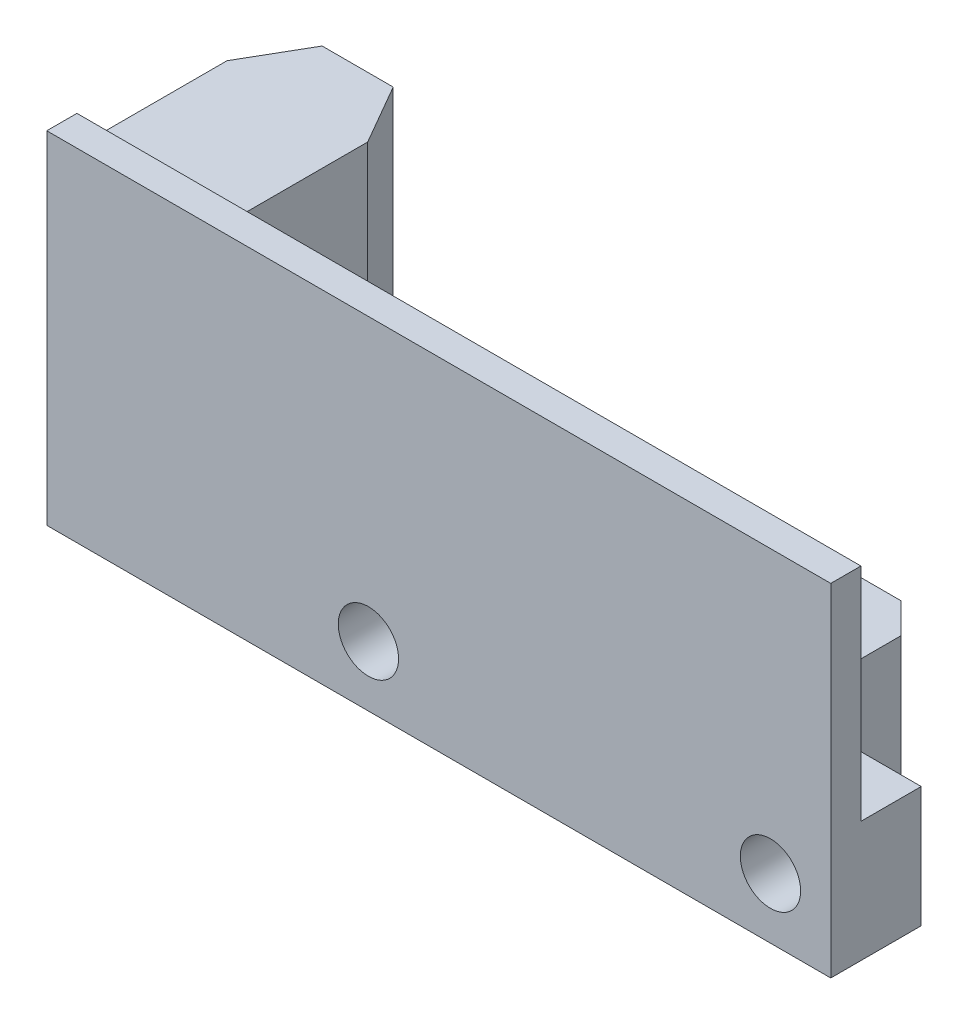
ISO-10303-21;
HEADER;
FILE_DESCRIPTION(('STEP AP214'),'2;1');
FILE_NAME('part.step','',(''),(''),'','','');
FILE_SCHEMA(('AUTOMOTIVE_DESIGN { 1 0 10303 214 1 1 1 1 }'));
ENDSEC;
DATA;
#1=APPLICATION_CONTEXT('core data for automotive mechanical design processes');
#2=APPLICATION_PROTOCOL_DEFINITION('international standard','automotive_design',2000,#1);
#3=PRODUCT_CONTEXT('',#1,'mechanical');
#4=PRODUCT('Part','Part','',(#3));
#5=PRODUCT_RELATED_PRODUCT_CATEGORY('part','',(#4));
#6=PRODUCT_DEFINITION_FORMATION('','',#4);
#7=PRODUCT_DEFINITION_CONTEXT('part definition',#1,'design');
#8=PRODUCT_DEFINITION('design','',#6,#7);
#9=PRODUCT_DEFINITION_SHAPE('','',#8);
#10=(LENGTH_UNIT() NAMED_UNIT(*) SI_UNIT(.MILLI.,.METRE.));
#11=(NAMED_UNIT(*) PLANE_ANGLE_UNIT() SI_UNIT($,.RADIAN.));
#12=(NAMED_UNIT(*) SI_UNIT($,.STERADIAN.) SOLID_ANGLE_UNIT());
#13=UNCERTAINTY_MEASURE_WITH_UNIT(LENGTH_MEASURE(1.E-05),#10,'distance_accuracy_value','');
#14=(GEOMETRIC_REPRESENTATION_CONTEXT(3) GLOBAL_UNCERTAINTY_ASSIGNED_CONTEXT((#13)) GLOBAL_UNIT_ASSIGNED_CONTEXT((#10,
#11,#12)) REPRESENTATION_CONTEXT('',''));
#15=CARTESIAN_POINT('',(0.,0.,0.));
#16=DIRECTION('',(0.,0.,1.));
#17=DIRECTION('',(1.,0.,0.));
#18=AXIS2_PLACEMENT_3D('',#15,#16,#17);
#19=CARTESIAN_POINT('',(0.,0.,0.));
#20=DIRECTION('',(0.,0.,1.));
#21=DIRECTION('',(1.,0.,0.));
#22=AXIS2_PLACEMENT_3D('',#19,#20,#21);
#23=PLANE('',#22);
#24=DIRECTION('',(1.,0.,0.));
#25=VECTOR('',#24,1.);
#26=CARTESIAN_POINT('',(-5.50000000000001,-2.5,0.));
#27=LINE('',#26,#25);
#28=CARTESIAN_POINT('',(-5.50000000000001,-2.5,0.));
#29=VERTEX_POINT('',#28);
#30=CARTESIAN_POINT('',(19.5,-2.5,0.));
#31=VERTEX_POINT('',#30);
#32=EDGE_CURVE('E280',#29,#31,#27,.T.);
#33=ORIENTED_EDGE('',*,*,#32,.F.);
#34=DIRECTION('',(0.,-1.,0.));
#35=VECTOR('',#34,1.);
#36=CARTESIAN_POINT('',(-5.50000000000001,-2.5,0.));
#37=LINE('',#36,#35);
#38=CARTESIAN_POINT('',(-5.50000000000001,-8.49999999999999,0.));
#39=VERTEX_POINT('',#38);
#40=EDGE_CURVE('E247',#29,#39,#37,.T.);
#41=ORIENTED_EDGE('',*,*,#40,.T.);
#42=DIRECTION('',(1.,0.,0.));
#43=VECTOR('',#42,1.);
#44=CARTESIAN_POINT('',(-19.5,-8.49999999999999,0.));
#45=LINE('',#44,#43);
#46=CARTESIAN_POINT('',(-19.5,-8.49999999999999,0.));
#47=VERTEX_POINT('',#46);
#48=EDGE_CURVE('E276',#47,#39,#45,.T.);
#49=ORIENTED_EDGE('',*,*,#48,.F.);
#50=DIRECTION('',(0.,-1.,0.));
#51=VECTOR('',#50,1.);
#52=CARTESIAN_POINT('',(-19.5,8.50000000000001,0.));
#53=LINE('',#52,#51);
#54=CARTESIAN_POINT('',(-19.5,8.50000000000001,0.));
#55=VERTEX_POINT('',#54);
#56=EDGE_CURVE('E441',#55,#47,#53,.T.);
#57=ORIENTED_EDGE('',*,*,#56,.F.);
#58=DIRECTION('',(-1.,0.,0.));
#59=VECTOR('',#58,1.);
#60=CARTESIAN_POINT('',(-19.5,8.50000000000001,0.));
#61=LINE('',#60,#59);
#62=CARTESIAN_POINT('',(19.5,8.50000000000001,0.));
#63=VERTEX_POINT('',#62);
#64=EDGE_CURVE('E437',#63,#55,#61,.T.);
#65=ORIENTED_EDGE('',*,*,#64,.F.);
#66=DIRECTION('',(0.,1.,0.));
#67=VECTOR('',#66,1.);
#68=CARTESIAN_POINT('',(19.5,8.50000000000001,0.));
#69=LINE('',#68,#67);
#70=EDGE_CURVE('E435',#31,#63,#69,.T.);
#71=ORIENTED_EDGE('',*,*,#70,.F.);
#72=EDGE_LOOP('',(#33,#41,#49,#57,#65,#71));
#73=FACE_BOUND('',#72,.T.);
#74=DIRECTION('',(0.,-1.,0.));
#75=VECTOR('',#74,1.);
#76=CARTESIAN_POINT('',(-12.0341939058667,7.5,0.));
#77=LINE('',#76,#75);
#78=CARTESIAN_POINT('',(-12.0341939058667,7.5,0.));
#79=VERTEX_POINT('',#78);
#80=CARTESIAN_POINT('',(-12.0341939058667,-7.5,0.));
#81=VERTEX_POINT('',#80);
#82=EDGE_CURVE('E185',#79,#81,#77,.T.);
#83=ORIENTED_EDGE('',*,*,#82,.F.);
#84=DIRECTION('',(1.,0.,0.));
#85=VECTOR('',#84,1.);
#86=CARTESIAN_POINT('',(-19.0341939058667,7.5,0.));
#87=LINE('',#86,#85);
#88=CARTESIAN_POINT('',(-19.0341939058667,7.5,0.));
#89=VERTEX_POINT('',#88);
#90=EDGE_CURVE('E197',#89,#79,#87,.T.);
#91=ORIENTED_EDGE('',*,*,#90,.F.);
#92=DIRECTION('',(0.,1.,0.));
#93=VECTOR('',#92,1.);
#94=CARTESIAN_POINT('',(-19.0341939058667,7.5,0.));
#95=LINE('',#94,#93);
#96=CARTESIAN_POINT('',(-19.0341939058667,-7.5,0.));
#97=VERTEX_POINT('',#96);
#98=EDGE_CURVE('E205',#97,#89,#95,.T.);
#99=ORIENTED_EDGE('',*,*,#98,.F.);
#100=DIRECTION('',(-1.,0.,0.));
#101=VECTOR('',#100,1.);
#102=CARTESIAN_POINT('',(-19.0341939058667,-7.5,0.));
#103=LINE('',#102,#101);
#104=EDGE_CURVE('E200',#81,#97,#103,.T.);
#105=ORIENTED_EDGE('',*,*,#104,.F.);
#106=EDGE_LOOP('',(#83,#91,#99,#105));
#107=FACE_BOUND('',#106,.T.);
#108=ADVANCED_FACE('F33',(#73,#107),#23,.F.);
#109=CARTESIAN_POINT('',(19.5,8.50000000000001,1.5));
#110=DIRECTION('',(-1.,0.,0.));
#111=DIRECTION('',(0.,-1.,0.));
#112=AXIS2_PLACEMENT_3D('',#109,#110,#111);
#113=PLANE('',#112);
#114=DIRECTION('',(0.,0.,-1.));
#115=VECTOR('',#114,1.);
#116=CARTESIAN_POINT('',(19.5,-8.49999999999999,1.5));
#117=LINE('',#116,#115);
#118=CARTESIAN_POINT('',(19.5,-8.49999999999999,1.5));
#119=VERTEX_POINT('',#118);
#120=CARTESIAN_POINT('',(19.5,-8.49999999999999,-3.));
#121=VERTEX_POINT('',#120);
#122=EDGE_CURVE('E455',#119,#121,#117,.T.);
#123=ORIENTED_EDGE('',*,*,#122,.T.);
#124=DIRECTION('',(0.,-1.,0.));
#125=VECTOR('',#124,1.);
#126=CARTESIAN_POINT('',(19.5,-2.5,-3.));
#127=LINE('',#126,#125);
#128=CARTESIAN_POINT('',(19.5,-2.5,-3.));
#129=VERTEX_POINT('',#128);
#130=EDGE_CURVE('E440',#129,#121,#127,.T.);
#131=ORIENTED_EDGE('',*,*,#130,.F.);
#132=DIRECTION('',(0.,0.,-1.));
#133=VECTOR('',#132,1.);
#134=CARTESIAN_POINT('',(19.5,-2.5,0.));
#135=LINE('',#134,#133);
#136=EDGE_CURVE('E228',#31,#129,#135,.T.);
#137=ORIENTED_EDGE('',*,*,#136,.F.);
#138=ORIENTED_EDGE('',*,*,#70,.T.);
#139=DIRECTION('',(0.,0.,-1.));
#140=VECTOR('',#139,1.);
#141=CARTESIAN_POINT('',(19.5,8.50000000000001,1.5));
#142=LINE('',#141,#140);
#143=CARTESIAN_POINT('',(19.5,8.50000000000001,1.5));
#144=VERTEX_POINT('',#143);
#145=EDGE_CURVE('E298',#144,#63,#142,.T.);
#146=ORIENTED_EDGE('',*,*,#145,.F.);
#147=DIRECTION('',(0.,1.,0.));
#148=VECTOR('',#147,1.);
#149=CARTESIAN_POINT('',(19.5,8.50000000000001,1.5));
#150=LINE('',#149,#148);
#151=EDGE_CURVE('E466',#119,#144,#150,.T.);
#152=ORIENTED_EDGE('',*,*,#151,.F.);
#153=EDGE_LOOP('',(#123,#131,#137,#138,#146,#152));
#154=FACE_BOUND('',#153,.T.);
#155=ADVANCED_FACE('F332',(#154),#113,.F.);
#156=CARTESIAN_POINT('',(-19.5,8.50000000000001,1.5));
#157=DIRECTION('',(0.,-1.,0.));
#158=DIRECTION('',(0.,0.,-1.));
#159=AXIS2_PLACEMENT_3D('',#156,#157,#158);
#160=PLANE('',#159);
#161=ORIENTED_EDGE('',*,*,#64,.T.);
#162=DIRECTION('',(0.,0.,-1.));
#163=VECTOR('',#162,1.);
#164=CARTESIAN_POINT('',(-19.5,8.50000000000001,1.5));
#165=LINE('',#164,#163);
#166=CARTESIAN_POINT('',(-19.5,8.50000000000001,1.5));
#167=VERTEX_POINT('',#166);
#168=EDGE_CURVE('E459',#167,#55,#165,.T.);
#169=ORIENTED_EDGE('',*,*,#168,.F.);
#170=DIRECTION('',(-1.,0.,0.));
#171=VECTOR('',#170,1.);
#172=CARTESIAN_POINT('',(-19.5,8.50000000000001,1.5));
#173=LINE('',#172,#171);
#174=EDGE_CURVE('E463',#144,#167,#173,.T.);
#175=ORIENTED_EDGE('',*,*,#174,.F.);
#176=ORIENTED_EDGE('',*,*,#145,.T.);
#177=EDGE_LOOP('',(#161,#169,#175,#176));
#178=FACE_BOUND('',#177,.T.);
#179=ADVANCED_FACE('F338',(#178),#160,.F.);
#180=CARTESIAN_POINT('',(-19.5,8.50000000000001,1.5));
#181=DIRECTION('',(1.,0.,0.));
#182=DIRECTION('',(0.,1.,0.));
#183=AXIS2_PLACEMENT_3D('',#180,#181,#182);
#184=PLANE('',#183);
#185=ORIENTED_EDGE('',*,*,#56,.T.);
#186=DIRECTION('',(0.,0.,-1.));
#187=VECTOR('',#186,1.);
#188=CARTESIAN_POINT('',(-19.5,-8.49999999999999,1.5));
#189=LINE('',#188,#187);
#190=CARTESIAN_POINT('',(-19.5,-8.49999999999999,1.5));
#191=VERTEX_POINT('',#190);
#192=EDGE_CURVE('E457',#191,#47,#189,.T.);
#193=ORIENTED_EDGE('',*,*,#192,.F.);
#194=DIRECTION('',(0.,-1.,0.));
#195=VECTOR('',#194,1.);
#196=CARTESIAN_POINT('',(-19.5,8.50000000000001,1.5));
#197=LINE('',#196,#195);
#198=EDGE_CURVE('E470',#167,#191,#197,.T.);
#199=ORIENTED_EDGE('',*,*,#198,.F.);
#200=ORIENTED_EDGE('',*,*,#168,.T.);
#201=EDGE_LOOP('',(#185,#193,#199,#200));
#202=FACE_BOUND('',#201,.T.);
#203=ADVANCED_FACE('F349',(#202),#184,.F.);
#204=CARTESIAN_POINT('',(-19.5,-8.49999999999999,1.5));
#205=DIRECTION('',(0.,1.,0.));
#206=DIRECTION('',(0.,0.,1.));
#207=AXIS2_PLACEMENT_3D('',#204,#205,#206);
#208=PLANE('',#207);
#209=DIRECTION('',(-1.,0.,0.));
#210=VECTOR('',#209,1.);
#211=CARTESIAN_POINT('',(12.5,-8.49999999999999,-10.5));
#212=LINE('',#211,#210);
#213=CARTESIAN_POINT('',(11.,-8.49999999999999,-10.5));
#214=VERTEX_POINT('',#213);
#215=CARTESIAN_POINT('',(8.49999999999999,-8.49999999999999,-10.5));
#216=VERTEX_POINT('',#215);
#217=EDGE_CURVE('E253',#214,#216,#212,.T.);
#218=ORIENTED_EDGE('',*,*,#217,.F.);
#219=DIRECTION('',(-0.707106781186546,0.,-0.707106781186549));
#220=VECTOR('',#219,1.);
#221=CARTESIAN_POINT('',(11.,-8.49999999999999,-10.5));
#222=LINE('',#221,#220);
#223=CARTESIAN_POINT('',(12.5,-8.49999999999999,-8.99999999999999));
#224=VERTEX_POINT('',#223);
#225=EDGE_CURVE('E297',#214,#224,#222,.F.);
#226=ORIENTED_EDGE('',*,*,#225,.T.);
#227=DIRECTION('',(0.,0.,-1.));
#228=VECTOR('',#227,1.);
#229=CARTESIAN_POINT('',(12.5,-8.49999999999999,-3.));
#230=LINE('',#229,#228);
#231=CARTESIAN_POINT('',(12.5,-8.49999999999999,-3.));
#232=VERTEX_POINT('',#231);
#233=EDGE_CURVE('E250',#232,#224,#230,.T.);
#234=ORIENTED_EDGE('',*,*,#233,.F.);
#235=DIRECTION('',(-1.,0.,0.));
#236=VECTOR('',#235,1.);
#237=CARTESIAN_POINT('',(19.5,-8.49999999999999,-3.));
#238=LINE('',#237,#236);
#239=EDGE_CURVE('E248',#121,#232,#238,.T.);
#240=ORIENTED_EDGE('',*,*,#239,.F.);
#241=ORIENTED_EDGE('',*,*,#122,.F.);
#242=DIRECTION('',(1.,0.,0.));
#243=VECTOR('',#242,1.);
#244=CARTESIAN_POINT('',(-19.5,-8.49999999999999,1.5));
#245=LINE('',#244,#243);
#246=EDGE_CURVE('E450',#191,#119,#245,.T.);
#247=ORIENTED_EDGE('',*,*,#246,.F.);
#248=ORIENTED_EDGE('',*,*,#192,.T.);
#249=ORIENTED_EDGE('',*,*,#48,.T.);
#250=DIRECTION('',(0.,0.,1.));
#251=VECTOR('',#250,1.);
#252=CARTESIAN_POINT('',(-5.50000000000001,-8.49999999999999,-3.));
#253=LINE('',#252,#251);
#254=CARTESIAN_POINT('',(-5.50000000000001,-8.49999999999999,-3.));
#255=VERTEX_POINT('',#254);
#256=EDGE_CURVE('E267',#255,#39,#253,.T.);
#257=ORIENTED_EDGE('',*,*,#256,.F.);
#258=DIRECTION('',(-1.,0.,0.));
#259=VECTOR('',#258,1.);
#260=CARTESIAN_POINT('',(1.5,-8.49999999999999,-3.));
#261=LINE('',#260,#259);
#262=CARTESIAN_POINT('',(1.5,-8.49999999999999,-3.));
#263=VERTEX_POINT('',#262);
#264=EDGE_CURVE('E265',#263,#255,#261,.T.);
#265=ORIENTED_EDGE('',*,*,#264,.F.);
#266=DIRECTION('',(0.,0.,1.));
#267=VECTOR('',#266,1.);
#268=CARTESIAN_POINT('',(1.49999999999999,-8.49999999999999,-10.5));
#269=LINE('',#268,#267);
#270=CARTESIAN_POINT('',(1.49999999999999,-8.49999999999999,-10.5));
#271=VERTEX_POINT('',#270);
#272=EDGE_CURVE('E263',#271,#263,#269,.T.);
#273=ORIENTED_EDGE('',*,*,#272,.F.);
#274=DIRECTION('',(-1.,0.,0.));
#275=VECTOR('',#274,1.);
#276=CARTESIAN_POINT('',(5.49999999999999,-8.49999999999999,-10.5));
#277=LINE('',#276,#275);
#278=CARTESIAN_POINT('',(5.49999999999999,-8.49999999999999,-10.5));
#279=VERTEX_POINT('',#278);
#280=EDGE_CURVE('E261',#279,#271,#277,.T.);
#281=ORIENTED_EDGE('',*,*,#280,.F.);
#282=DIRECTION('',(0.,0.,-1.));
#283=VECTOR('',#282,1.);
#284=CARTESIAN_POINT('',(5.49999999999999,-8.49999999999999,-3.));
#285=LINE('',#284,#283);
#286=CARTESIAN_POINT('',(5.49999999999999,-8.49999999999999,-3.));
#287=VERTEX_POINT('',#286);
#288=EDGE_CURVE('E259',#287,#279,#285,.T.);
#289=ORIENTED_EDGE('',*,*,#288,.F.);
#290=DIRECTION('',(-1.,0.,0.));
#291=VECTOR('',#290,1.);
#292=CARTESIAN_POINT('',(8.49999999999999,-8.49999999999999,-3.));
#293=LINE('',#292,#291);
#294=CARTESIAN_POINT('',(8.49999999999999,-8.49999999999999,-3.));
#295=VERTEX_POINT('',#294);
#296=EDGE_CURVE('E257',#295,#287,#293,.T.);
#297=ORIENTED_EDGE('',*,*,#296,.F.);
#298=DIRECTION('',(0.,0.,1.));
#299=VECTOR('',#298,1.);
#300=CARTESIAN_POINT('',(8.49999999999999,-8.49999999999999,-10.5));
#301=LINE('',#300,#299);
#302=EDGE_CURVE('E255',#216,#295,#301,.T.);
#303=ORIENTED_EDGE('',*,*,#302,.F.);
#304=EDGE_LOOP('',(#218,#226,#234,#240,#241,#247,#248,#249,#257,#265,#273,#281,#289,#297,#303));
#305=FACE_BOUND('',#304,.T.);
#306=ADVANCED_FACE('F346',(#305),#208,.F.);
#307=CARTESIAN_POINT('',(0.,0.,1.5));
#308=DIRECTION('',(0.,0.,1.));
#309=DIRECTION('',(1.,0.,0.));
#310=AXIS2_PLACEMENT_3D('',#307,#308,#309);
#311=PLANE('',#310);
#312=CARTESIAN_POINT('',(-3.50000000000001,-5.49999999999999,1.5));
#313=DIRECTION('',(0.,0.,1.));
#314=DIRECTION('',(1.,0.,0.));
#315=AXIS2_PLACEMENT_3D('',#312,#313,#314);
#316=CIRCLE('',#315,1.5);
#317=CARTESIAN_POINT('',(-2.00000000000001,-5.49999999999999,1.5));
#318=VERTEX_POINT('',#317);
#319=EDGE_CURVE('E217',#318,#318,#316,.T.);
#320=ORIENTED_EDGE('',*,*,#319,.F.);
#321=EDGE_LOOP('',(#320));
#322=FACE_BOUND('',#321,.T.);
#323=CARTESIAN_POINT('',(16.5,-5.49999999999999,1.5));
#324=DIRECTION('',(0.,0.,1.));
#325=DIRECTION('',(1.,0.,0.));
#326=AXIS2_PLACEMENT_3D('',#323,#324,#325);
#327=CIRCLE('',#326,1.5);
#328=CARTESIAN_POINT('',(18.,-5.49999999999999,1.5));
#329=VERTEX_POINT('',#328);
#330=EDGE_CURVE('E221',#329,#329,#327,.T.);
#331=ORIENTED_EDGE('',*,*,#330,.F.);
#332=EDGE_LOOP('',(#331));
#333=FACE_BOUND('',#332,.T.);
#334=ORIENTED_EDGE('',*,*,#151,.T.);
#335=ORIENTED_EDGE('',*,*,#174,.T.);
#336=ORIENTED_EDGE('',*,*,#198,.T.);
#337=ORIENTED_EDGE('',*,*,#246,.T.);
#338=EDGE_LOOP('',(#334,#335,#336,#337));
#339=FACE_BOUND('',#338,.T.);
#340=ADVANCED_FACE('F344',(#322,#333,#339),#311,.T.);
#341=CARTESIAN_POINT('',(19.5,-2.5,-3.));
#342=DIRECTION('',(0.,0.,1.));
#343=DIRECTION('',(1.,0.,0.));
#344=AXIS2_PLACEMENT_3D('',#341,#342,#343);
#345=PLANE('',#344);
#346=CARTESIAN_POINT('',(16.5,-5.49999999999999,-3.));
#347=DIRECTION('',(0.,0.,1.));
#348=DIRECTION('',(1.,0.,0.));
#349=AXIS2_PLACEMENT_3D('',#346,#347,#348);
#350=CIRCLE('',#349,1.5);
#351=CARTESIAN_POINT('',(18.,-5.49999999999999,-3.));
#352=VERTEX_POINT('',#351);
#353=EDGE_CURVE('E224',#352,#352,#350,.T.);
#354=ORIENTED_EDGE('',*,*,#353,.T.);
#355=EDGE_LOOP('',(#354));
#356=FACE_BOUND('',#355,.T.);
#357=ORIENTED_EDGE('',*,*,#239,.T.);
#358=DIRECTION('',(0.,-1.,0.));
#359=VECTOR('',#358,1.);
#360=CARTESIAN_POINT('',(12.5,-2.5,-3.));
#361=LINE('',#360,#359);
#362=CARTESIAN_POINT('',(12.5,-2.5,-3.));
#363=VERTEX_POINT('',#362);
#364=EDGE_CURVE('E385',#363,#232,#361,.T.);
#365=ORIENTED_EDGE('',*,*,#364,.F.);
#366=DIRECTION('',(-1.,0.,0.));
#367=VECTOR('',#366,1.);
#368=CARTESIAN_POINT('',(19.5,-2.5,-3.));
#369=LINE('',#368,#367);
#370=EDGE_CURVE('E225',#129,#363,#369,.T.);
#371=ORIENTED_EDGE('',*,*,#370,.F.);
#372=ORIENTED_EDGE('',*,*,#130,.T.);
#373=EDGE_LOOP('',(#357,#365,#371,#372));
#374=FACE_BOUND('',#373,.T.);
#375=ADVANCED_FACE('F481',(#356,#374),#345,.F.);
#376=CARTESIAN_POINT('',(12.5,-2.5,-3.));
#377=DIRECTION('',(-1.,0.,0.));
#378=DIRECTION('',(0.,0.,1.));
#379=AXIS2_PLACEMENT_3D('',#376,#377,#378);
#380=PLANE('',#379);
#381=ORIENTED_EDGE('',*,*,#233,.T.);
#382=DIRECTION('',(0.,1.,0.));
#383=VECTOR('',#382,1.);
#384=CARTESIAN_POINT('',(12.5,-2.5,-8.99999999999999));
#385=LINE('',#384,#383);
#386=CARTESIAN_POINT('',(12.5,-2.5,-8.99999999999999));
#387=VERTEX_POINT('',#386);
#388=EDGE_CURVE('E300',#224,#387,#385,.T.);
#389=ORIENTED_EDGE('',*,*,#388,.T.);
#390=DIRECTION('',(0.,0.,-1.));
#391=VECTOR('',#390,1.);
#392=CARTESIAN_POINT('',(12.5,-2.5,-3.));
#393=LINE('',#392,#391);
#394=EDGE_CURVE('E227',#363,#387,#393,.T.);
#395=ORIENTED_EDGE('',*,*,#394,.F.);
#396=ORIENTED_EDGE('',*,*,#364,.T.);
#397=EDGE_LOOP('',(#381,#389,#395,#396));
#398=FACE_BOUND('',#397,.T.);
#399=ADVANCED_FACE('F484',(#398),#380,.F.);
#400=CARTESIAN_POINT('',(12.5,-2.5,-10.5));
#401=DIRECTION('',(0.,0.,1.));
#402=DIRECTION('',(1.,0.,0.));
#403=AXIS2_PLACEMENT_3D('',#400,#401,#402);
#404=PLANE('',#403);
#405=DIRECTION('',(-1.,0.,0.));
#406=VECTOR('',#405,1.);
#407=CARTESIAN_POINT('',(12.5,-2.5,-10.5));
#408=LINE('',#407,#406);
#409=CARTESIAN_POINT('',(11.,-2.5,-10.5));
#410=VERTEX_POINT('',#409);
#411=CARTESIAN_POINT('',(8.49999999999999,-2.5,-10.5));
#412=VERTEX_POINT('',#411);
#413=EDGE_CURVE('E231',#410,#412,#408,.T.);
#414=ORIENTED_EDGE('',*,*,#413,.F.);
#415=DIRECTION('',(0.,-1.,0.));
#416=VECTOR('',#415,1.);
#417=CARTESIAN_POINT('',(11.,-2.5,-10.5));
#418=LINE('',#417,#416);
#419=EDGE_CURVE('E294',#410,#214,#418,.T.);
#420=ORIENTED_EDGE('',*,*,#419,.T.);
#421=ORIENTED_EDGE('',*,*,#217,.T.);
#422=DIRECTION('',(0.,-1.,0.));
#423=VECTOR('',#422,1.);
#424=CARTESIAN_POINT('',(8.49999999999999,-2.5,-10.5));
#425=LINE('',#424,#423);
#426=EDGE_CURVE('E381',#412,#216,#425,.T.);
#427=ORIENTED_EDGE('',*,*,#426,.F.);
#428=EDGE_LOOP('',(#414,#420,#421,#427));
#429=FACE_BOUND('',#428,.T.);
#430=ADVANCED_FACE('F378',(#429),#404,.F.);
#431=CARTESIAN_POINT('',(8.49999999999999,-2.5,-10.5));
#432=DIRECTION('',(1.,0.,0.));
#433=DIRECTION('',(0.,0.,-1.));
#434=AXIS2_PLACEMENT_3D('',#431,#432,#433);
#435=PLANE('',#434);
#436=ORIENTED_EDGE('',*,*,#302,.T.);
#437=DIRECTION('',(0.,-1.,0.));
#438=VECTOR('',#437,1.);
#439=CARTESIAN_POINT('',(8.49999999999999,-2.5,-3.));
#440=LINE('',#439,#438);
#441=CARTESIAN_POINT('',(8.49999999999999,-2.5,-3.));
#442=VERTEX_POINT('',#441);
#443=EDGE_CURVE('E386',#442,#295,#440,.T.);
#444=ORIENTED_EDGE('',*,*,#443,.F.);
#445=DIRECTION('',(0.,0.,1.));
#446=VECTOR('',#445,1.);
#447=CARTESIAN_POINT('',(8.49999999999999,-2.5,-10.5));
#448=LINE('',#447,#446);
#449=EDGE_CURVE('E233',#412,#442,#448,.T.);
#450=ORIENTED_EDGE('',*,*,#449,.F.);
#451=ORIENTED_EDGE('',*,*,#426,.T.);
#452=EDGE_LOOP('',(#436,#444,#450,#451));
#453=FACE_BOUND('',#452,.T.);
#454=ADVANCED_FACE('F389',(#453),#435,.F.);
#455=CARTESIAN_POINT('',(8.49999999999999,-2.5,-3.));
#456=DIRECTION('',(0.,0.,1.));
#457=DIRECTION('',(1.,0.,0.));
#458=AXIS2_PLACEMENT_3D('',#455,#456,#457);
#459=PLANE('',#458);
#460=ORIENTED_EDGE('',*,*,#296,.T.);
#461=DIRECTION('',(0.,-1.,0.));
#462=VECTOR('',#461,1.);
#463=CARTESIAN_POINT('',(5.49999999999999,-2.5,-3.));
#464=LINE('',#463,#462);
#465=CARTESIAN_POINT('',(5.49999999999999,-2.5,-3.));
#466=VERTEX_POINT('',#465);
#467=EDGE_CURVE('E397',#466,#287,#464,.T.);
#468=ORIENTED_EDGE('',*,*,#467,.F.);
#469=DIRECTION('',(-1.,0.,0.));
#470=VECTOR('',#469,1.);
#471=CARTESIAN_POINT('',(8.49999999999999,-2.5,-3.));
#472=LINE('',#471,#470);
#473=EDGE_CURVE('E235',#442,#466,#472,.T.);
#474=ORIENTED_EDGE('',*,*,#473,.F.);
#475=ORIENTED_EDGE('',*,*,#443,.T.);
#476=EDGE_LOOP('',(#460,#468,#474,#475));
#477=FACE_BOUND('',#476,.T.);
#478=ADVANCED_FACE('F398',(#477),#459,.F.);
#479=CARTESIAN_POINT('',(5.49999999999999,-2.5,-3.));
#480=DIRECTION('',(-1.,0.,0.));
#481=DIRECTION('',(0.,0.,1.));
#482=AXIS2_PLACEMENT_3D('',#479,#480,#481);
#483=PLANE('',#482);
#484=ORIENTED_EDGE('',*,*,#288,.T.);
#485=DIRECTION('',(0.,-1.,0.));
#486=VECTOR('',#485,1.);
#487=CARTESIAN_POINT('',(5.49999999999999,-2.5,-10.5));
#488=LINE('',#487,#486);
#489=CARTESIAN_POINT('',(5.49999999999999,-2.5,-10.5));
#490=VERTEX_POINT('',#489);
#491=EDGE_CURVE('E402',#490,#279,#488,.T.);
#492=ORIENTED_EDGE('',*,*,#491,.F.);
#493=DIRECTION('',(0.,0.,-1.));
#494=VECTOR('',#493,1.);
#495=CARTESIAN_POINT('',(5.49999999999999,-2.5,-3.));
#496=LINE('',#495,#494);
#497=EDGE_CURVE('E237',#466,#490,#496,.T.);
#498=ORIENTED_EDGE('',*,*,#497,.F.);
#499=ORIENTED_EDGE('',*,*,#467,.T.);
#500=EDGE_LOOP('',(#484,#492,#498,#499));
#501=FACE_BOUND('',#500,.T.);
#502=ADVANCED_FACE('F404',(#501),#483,.F.);
#503=CARTESIAN_POINT('',(5.49999999999999,-2.5,-10.5));
#504=DIRECTION('',(0.,0.,1.));
#505=DIRECTION('',(1.,0.,0.));
#506=AXIS2_PLACEMENT_3D('',#503,#504,#505);
#507=PLANE('',#506);
#508=ORIENTED_EDGE('',*,*,#280,.T.);
#509=DIRECTION('',(0.,-1.,0.));
#510=VECTOR('',#509,1.);
#511=CARTESIAN_POINT('',(1.49999999999999,-2.5,-10.5));
#512=LINE('',#511,#510);
#513=CARTESIAN_POINT('',(1.49999999999999,-2.5,-10.5));
#514=VERTEX_POINT('',#513);
#515=EDGE_CURVE('E409',#514,#271,#512,.T.);
#516=ORIENTED_EDGE('',*,*,#515,.F.);
#517=DIRECTION('',(-1.,0.,0.));
#518=VECTOR('',#517,1.);
#519=CARTESIAN_POINT('',(5.49999999999999,-2.5,-10.5));
#520=LINE('',#519,#518);
#521=EDGE_CURVE('E239',#490,#514,#520,.T.);
#522=ORIENTED_EDGE('',*,*,#521,.F.);
#523=ORIENTED_EDGE('',*,*,#491,.T.);
#524=EDGE_LOOP('',(#508,#516,#522,#523));
#525=FACE_BOUND('',#524,.T.);
#526=ADVANCED_FACE('F412',(#525),#507,.F.);
#527=CARTESIAN_POINT('',(1.49999999999999,-2.5,-10.5));
#528=DIRECTION('',(1.,0.,0.));
#529=DIRECTION('',(0.,0.,-1.));
#530=AXIS2_PLACEMENT_3D('',#527,#528,#529);
#531=PLANE('',#530);
#532=ORIENTED_EDGE('',*,*,#272,.T.);
#533=DIRECTION('',(0.,-1.,0.));
#534=VECTOR('',#533,1.);
#535=CARTESIAN_POINT('',(1.5,-2.5,-3.));
#536=LINE('',#535,#534);
#537=CARTESIAN_POINT('',(1.5,-2.5,-3.));
#538=VERTEX_POINT('',#537);
#539=EDGE_CURVE('E420',#538,#263,#536,.T.);
#540=ORIENTED_EDGE('',*,*,#539,.F.);
#541=DIRECTION('',(0.,0.,1.));
#542=VECTOR('',#541,1.);
#543=CARTESIAN_POINT('',(1.49999999999999,-2.5,-10.5));
#544=LINE('',#543,#542);
#545=EDGE_CURVE('E241',#514,#538,#544,.T.);
#546=ORIENTED_EDGE('',*,*,#545,.F.);
#547=ORIENTED_EDGE('',*,*,#515,.T.);
#548=EDGE_LOOP('',(#532,#540,#546,#547));
#549=FACE_BOUND('',#548,.T.);
#550=ADVANCED_FACE('F421',(#549),#531,.F.);
#551=CARTESIAN_POINT('',(1.5,-2.5,-3.));
#552=DIRECTION('',(0.,0.,1.));
#553=DIRECTION('',(1.,0.,0.));
#554=AXIS2_PLACEMENT_3D('',#551,#552,#553);
#555=PLANE('',#554);
#556=CARTESIAN_POINT('',(-3.50000000000001,-5.49999999999999,-3.));
#557=DIRECTION('',(0.,0.,1.));
#558=DIRECTION('',(1.,0.,0.));
#559=AXIS2_PLACEMENT_3D('',#556,#557,#558);
#560=CIRCLE('',#559,1.5);
#561=CARTESIAN_POINT('',(-2.00000000000001,-5.49999999999999,-3.));
#562=VERTEX_POINT('',#561);
#563=EDGE_CURVE('E220',#562,#562,#560,.T.);
#564=ORIENTED_EDGE('',*,*,#563,.T.);
#565=EDGE_LOOP('',(#564));
#566=FACE_BOUND('',#565,.T.);
#567=ORIENTED_EDGE('',*,*,#264,.T.);
#568=DIRECTION('',(0.,-1.,0.));
#569=VECTOR('',#568,1.);
#570=CARTESIAN_POINT('',(-5.50000000000001,-2.5,-3.));
#571=LINE('',#570,#569);
#572=CARTESIAN_POINT('',(-5.50000000000001,-2.5,-3.));
#573=VERTEX_POINT('',#572);
#574=EDGE_CURVE('E270',#573,#255,#571,.T.);
#575=ORIENTED_EDGE('',*,*,#574,.F.);
#576=DIRECTION('',(-1.,0.,0.));
#577=VECTOR('',#576,1.);
#578=CARTESIAN_POINT('',(1.5,-2.5,-3.));
#579=LINE('',#578,#577);
#580=EDGE_CURVE('E243',#538,#573,#579,.T.);
#581=ORIENTED_EDGE('',*,*,#580,.F.);
#582=ORIENTED_EDGE('',*,*,#539,.T.);
#583=EDGE_LOOP('',(#567,#575,#581,#582));
#584=FACE_BOUND('',#583,.T.);
#585=ADVANCED_FACE('F425',(#566,#584),#555,.F.);
#586=CARTESIAN_POINT('',(-5.50000000000001,-2.5,-3.));
#587=DIRECTION('',(1.,0.,0.));
#588=DIRECTION('',(0.,0.,-1.));
#589=AXIS2_PLACEMENT_3D('',#586,#587,#588);
#590=PLANE('',#589);
#591=ORIENTED_EDGE('',*,*,#256,.T.);
#592=ORIENTED_EDGE('',*,*,#40,.F.);
#593=DIRECTION('',(0.,0.,1.));
#594=VECTOR('',#593,1.);
#595=CARTESIAN_POINT('',(-5.50000000000001,-2.5,-3.));
#596=LINE('',#595,#594);
#597=EDGE_CURVE('E245',#573,#29,#596,.T.);
#598=ORIENTED_EDGE('',*,*,#597,.F.);
#599=ORIENTED_EDGE('',*,*,#574,.T.);
#600=EDGE_LOOP('',(#591,#592,#598,#599));
#601=FACE_BOUND('',#600,.T.);
#602=ADVANCED_FACE('F431',(#601),#590,.F.);
#603=CARTESIAN_POINT('',(0.,-2.5,0.));
#604=DIRECTION('',(0.,1.,0.));
#605=DIRECTION('',(0.,0.,1.));
#606=AXIS2_PLACEMENT_3D('',#603,#604,#605);
#607=PLANE('',#606);
#608=ORIENTED_EDGE('',*,*,#394,.T.);
#609=DIRECTION('',(0.707106781186546,0.,0.707106781186549));
#610=VECTOR('',#609,1.);
#611=CARTESIAN_POINT('',(10.75,-2.5,-10.75));
#612=LINE('',#611,#610);
#613=EDGE_CURVE('E302',#387,#410,#612,.F.);
#614=ORIENTED_EDGE('',*,*,#613,.T.);
#615=ORIENTED_EDGE('',*,*,#413,.T.);
#616=ORIENTED_EDGE('',*,*,#449,.T.);
#617=ORIENTED_EDGE('',*,*,#473,.T.);
#618=ORIENTED_EDGE('',*,*,#497,.T.);
#619=ORIENTED_EDGE('',*,*,#521,.T.);
#620=ORIENTED_EDGE('',*,*,#545,.T.);
#621=ORIENTED_EDGE('',*,*,#580,.T.);
#622=ORIENTED_EDGE('',*,*,#597,.T.);
#623=ORIENTED_EDGE('',*,*,#32,.T.);
#624=ORIENTED_EDGE('',*,*,#136,.T.);
#625=ORIENTED_EDGE('',*,*,#370,.T.);
#626=EDGE_LOOP('',(#608,#614,#615,#616,#617,#618,#619,#620,#621,#622,#623,#624,#625));
#627=FACE_BOUND('',#626,.T.);
#628=ADVANCED_FACE('F374',(#627),#607,.T.);
#629=CARTESIAN_POINT('',(16.5,-5.49999999999999,-10.5));
#630=DIRECTION('',(0.,0.,1.));
#631=DIRECTION('',(1.,0.,0.));
#632=AXIS2_PLACEMENT_3D('',#629,#630,#631);
#633=CYLINDRICAL_SURFACE('',#632,1.5);
#634=ORIENTED_EDGE('',*,*,#330,.T.);
#635=EDGE_LOOP('',(#634));
#636=FACE_BOUND('',#635,.T.);
#637=ORIENTED_EDGE('',*,*,#353,.F.);
#638=EDGE_LOOP('',(#637));
#639=FACE_BOUND('',#638,.T.);
#640=ADVANCED_FACE('F366',(#636,#639),#633,.F.);
#641=CARTESIAN_POINT('',(-3.50000000000001,-5.49999999999999,-10.5));
#642=DIRECTION('',(0.,0.,1.));
#643=DIRECTION('',(1.,0.,0.));
#644=AXIS2_PLACEMENT_3D('',#641,#642,#643);
#645=CYLINDRICAL_SURFACE('',#644,1.5);
#646=ORIENTED_EDGE('',*,*,#319,.T.);
#647=EDGE_LOOP('',(#646));
#648=FACE_BOUND('',#647,.T.);
#649=ORIENTED_EDGE('',*,*,#563,.F.);
#650=EDGE_LOOP('',(#649));
#651=FACE_BOUND('',#650,.T.);
#652=ADVANCED_FACE('F359',(#648,#651),#645,.F.);
#653=CARTESIAN_POINT('',(11.,-2.5,-10.5));
#654=DIRECTION('',(-0.707106781186549,0.,0.707106781186546));
#655=DIRECTION('',(0.,-1.,0.));
#656=AXIS2_PLACEMENT_3D('',#653,#654,#655);
#657=PLANE('',#656);
#658=ORIENTED_EDGE('',*,*,#613,.F.);
#659=ORIENTED_EDGE('',*,*,#388,.F.);
#660=ORIENTED_EDGE('',*,*,#225,.F.);
#661=ORIENTED_EDGE('',*,*,#419,.F.);
#662=EDGE_LOOP('',(#658,#659,#660,#661));
#663=FACE_BOUND('',#662,.T.);
#664=ADVANCED_FACE('F357',(#663),#657,.F.);
#665=CARTESIAN_POINT('',(-12.0341939058667,7.5,-10.));
#666=DIRECTION('',(-1.,0.,0.));
#667=DIRECTION('',(0.,-1.,0.));
#668=AXIS2_PLACEMENT_3D('',#665,#666,#667);
#669=PLANE('',#668);
#670=DIRECTION('',(0.,0.,1.));
#671=VECTOR('',#670,1.);
#672=CARTESIAN_POINT('',(-12.0341939058667,-7.5,-10.));
#673=LINE('',#672,#671);
#674=CARTESIAN_POINT('',(-12.0341939058667,-7.5,-6.99999999999998));
#675=VERTEX_POINT('',#674);
#676=EDGE_CURVE('E215',#675,#81,#673,.T.);
#677=ORIENTED_EDGE('',*,*,#676,.F.);
#678=DIRECTION('',(0.,1.,0.));
#679=VECTOR('',#678,1.);
#680=CARTESIAN_POINT('',(-12.0341939058667,7.5,-6.99999999999998));
#681=LINE('',#680,#679);
#682=CARTESIAN_POINT('',(-12.0341939058667,7.5,-6.99999999999998));
#683=VERTEX_POINT('',#682);
#684=EDGE_CURVE('E11',#675,#683,#681,.T.);
#685=ORIENTED_EDGE('',*,*,#684,.T.);
#686=DIRECTION('',(0.,0.,1.));
#687=VECTOR('',#686,1.);
#688=CARTESIAN_POINT('',(-12.0341939058667,7.5,-10.));
#689=LINE('',#688,#687);
#690=EDGE_CURVE('E182',#683,#79,#689,.T.);
#691=ORIENTED_EDGE('',*,*,#690,.T.);
#692=ORIENTED_EDGE('',*,*,#82,.T.);
#693=EDGE_LOOP('',(#677,#685,#691,#692));
#694=FACE_BOUND('',#693,.T.);
#695=ADVANCED_FACE('F184',(#694),#669,.F.);
#696=CARTESIAN_POINT('',(-19.0341939058667,-7.5,-10.));
#697=DIRECTION('',(0.,1.,0.));
#698=DIRECTION('',(-1.,0.,0.));
#699=AXIS2_PLACEMENT_3D('',#696,#697,#698);
#700=PLANE('',#699);
#701=DIRECTION('',(0.,0.,1.));
#702=VECTOR('',#701,1.);
#703=CARTESIAN_POINT('',(-19.0341939058667,-7.5,-10.));
#704=LINE('',#703,#702);
#705=CARTESIAN_POINT('',(-19.0341939058667,-7.5,-6.99999999999998));
#706=VERTEX_POINT('',#705);
#707=EDGE_CURVE('E213',#706,#97,#704,.T.);
#708=ORIENTED_EDGE('',*,*,#707,.F.);
#709=DIRECTION('',(-0.499999999999998,0.,0.86602540378444));
#710=VECTOR('',#709,1.);
#711=CARTESIAN_POINT('',(-17.3021430982978,-7.5,-10.));
#712=LINE('',#711,#710);
#713=CARTESIAN_POINT('',(-17.3021430982978,-7.5,-10.));
#714=VERTEX_POINT('',#713);
#715=EDGE_CURVE('E41',#706,#714,#712,.F.);
#716=ORIENTED_EDGE('',*,*,#715,.T.);
#717=DIRECTION('',(-1.,0.,0.));
#718=VECTOR('',#717,1.);
#719=CARTESIAN_POINT('',(-19.0341939058667,-7.5,-10.));
#720=LINE('',#719,#718);
#721=CARTESIAN_POINT('',(-13.7662447134356,-7.5,-10.));
#722=VERTEX_POINT('',#721);
#723=EDGE_CURVE('E204',#722,#714,#720,.T.);
#724=ORIENTED_EDGE('',*,*,#723,.F.);
#725=DIRECTION('',(-0.499999999999999,0.,-0.866025403784439));
#726=VECTOR('',#725,1.);
#727=CARTESIAN_POINT('',(-13.7662447134356,-7.5,-10.));
#728=LINE('',#727,#726);
#729=EDGE_CURVE('E48',#722,#675,#728,.F.);
#730=ORIENTED_EDGE('',*,*,#729,.T.);
#731=ORIENTED_EDGE('',*,*,#676,.T.);
#732=ORIENTED_EDGE('',*,*,#104,.T.);
#733=EDGE_LOOP('',(#708,#716,#724,#730,#731,#732));
#734=FACE_BOUND('',#733,.T.);
#735=ADVANCED_FACE('F316',(#734),#700,.F.);
#736=CARTESIAN_POINT('',(-19.0341939058667,7.5,-10.));
#737=DIRECTION('',(1.,0.,0.));
#738=DIRECTION('',(0.,0.,-1.));
#739=AXIS2_PLACEMENT_3D('',#736,#737,#738);
#740=PLANE('',#739);
#741=DIRECTION('',(0.,0.,1.));
#742=VECTOR('',#741,1.);
#743=CARTESIAN_POINT('',(-19.0341939058667,7.5,-10.));
#744=LINE('',#743,#742);
#745=CARTESIAN_POINT('',(-19.0341939058667,7.5,-6.99999999999998));
#746=VERTEX_POINT('',#745);
#747=EDGE_CURVE('E190',#746,#89,#744,.T.);
#748=ORIENTED_EDGE('',*,*,#747,.F.);
#749=DIRECTION('',(0.,-1.,0.));
#750=VECTOR('',#749,1.);
#751=CARTESIAN_POINT('',(-19.0341939058667,7.5,-6.99999999999998));
#752=LINE('',#751,#750);
#753=EDGE_CURVE('E56',#746,#706,#752,.T.);
#754=ORIENTED_EDGE('',*,*,#753,.T.);
#755=ORIENTED_EDGE('',*,*,#707,.T.);
#756=ORIENTED_EDGE('',*,*,#98,.T.);
#757=EDGE_LOOP('',(#748,#754,#755,#756));
#758=FACE_BOUND('',#757,.T.);
#759=ADVANCED_FACE('F324',(#758),#740,.F.);
#760=CARTESIAN_POINT('',(-19.0341939058667,7.5,-10.));
#761=DIRECTION('',(0.,-1.,0.));
#762=DIRECTION('',(1.,0.,0.));
#763=AXIS2_PLACEMENT_3D('',#760,#761,#762);
#764=PLANE('',#763);
#765=DIRECTION('',(1.,0.,0.));
#766=VECTOR('',#765,1.);
#767=CARTESIAN_POINT('',(-19.0341939058667,7.5,-10.));
#768=LINE('',#767,#766);
#769=CARTESIAN_POINT('',(-17.3021430982978,7.5,-10.));
#770=VERTEX_POINT('',#769);
#771=CARTESIAN_POINT('',(-13.7662447134356,7.5,-10.));
#772=VERTEX_POINT('',#771);
#773=EDGE_CURVE('E191',#770,#772,#768,.T.);
#774=ORIENTED_EDGE('',*,*,#773,.F.);
#775=DIRECTION('',(0.499999999999998,0.,-0.86602540378444));
#776=VECTOR('',#775,1.);
#777=CARTESIAN_POINT('',(-17.3021430982978,7.5,-10.));
#778=LINE('',#777,#776);
#779=EDGE_CURVE('E312',#770,#746,#778,.F.);
#780=ORIENTED_EDGE('',*,*,#779,.T.);
#781=ORIENTED_EDGE('',*,*,#747,.T.);
#782=ORIENTED_EDGE('',*,*,#90,.T.);
#783=ORIENTED_EDGE('',*,*,#690,.F.);
#784=DIRECTION('',(0.499999999999999,0.,0.866025403784439));
#785=VECTOR('',#784,1.);
#786=CARTESIAN_POINT('',(-13.7662447134356,7.5,-10.));
#787=LINE('',#786,#785);
#788=EDGE_CURVE('E310',#683,#772,#787,.F.);
#789=ORIENTED_EDGE('',*,*,#788,.T.);
#790=EDGE_LOOP('',(#774,#780,#781,#782,#783,#789));
#791=FACE_BOUND('',#790,.T.);
#792=ADVANCED_FACE('F203',(#791),#764,.F.);
#793=CARTESIAN_POINT('',(0.,0.,-10.));
#794=DIRECTION('',(0.,0.,1.));
#795=DIRECTION('',(1.,0.,0.));
#796=AXIS2_PLACEMENT_3D('',#793,#794,#795);
#797=PLANE('',#796);
#798=ORIENTED_EDGE('',*,*,#723,.T.);
#799=DIRECTION('',(0.,1.,0.));
#800=VECTOR('',#799,1.);
#801=CARTESIAN_POINT('',(-17.3021430982978,0.,-10.));
#802=LINE('',#801,#800);
#803=EDGE_CURVE('E307',#714,#770,#802,.T.);
#804=ORIENTED_EDGE('',*,*,#803,.T.);
#805=ORIENTED_EDGE('',*,*,#773,.T.);
#806=DIRECTION('',(0.,-1.,0.));
#807=VECTOR('',#806,1.);
#808=CARTESIAN_POINT('',(-13.7662447134356,0.,-10.));
#809=LINE('',#808,#807);
#810=EDGE_CURVE('E304',#772,#722,#809,.T.);
#811=ORIENTED_EDGE('',*,*,#810,.T.);
#812=EDGE_LOOP('',(#798,#804,#805,#811));
#813=FACE_BOUND('',#812,.T.);
#814=ADVANCED_FACE('F320',(#813),#797,.F.);
#815=CARTESIAN_POINT('',(-17.3021430982978,0.,-10.));
#816=DIRECTION('',(0.86602540378444,0.,0.499999999999998));
#817=DIRECTION('',(0.,1.,0.));
#818=AXIS2_PLACEMENT_3D('',#815,#816,#817);
#819=PLANE('',#818);
#820=ORIENTED_EDGE('',*,*,#715,.F.);
#821=ORIENTED_EDGE('',*,*,#753,.F.);
#822=ORIENTED_EDGE('',*,*,#779,.F.);
#823=ORIENTED_EDGE('',*,*,#803,.F.);
#824=EDGE_LOOP('',(#820,#821,#822,#823));
#825=FACE_BOUND('',#824,.T.);
#826=ADVANCED_FACE('F323',(#825),#819,.F.);
#827=CARTESIAN_POINT('',(-13.7662447134356,0.,-10.));
#828=DIRECTION('',(-0.866025403784439,0.,0.499999999999999));
#829=DIRECTION('',(0.,-1.,0.));
#830=AXIS2_PLACEMENT_3D('',#827,#828,#829);
#831=PLANE('',#830);
#832=ORIENTED_EDGE('',*,*,#788,.F.);
#833=ORIENTED_EDGE('',*,*,#684,.F.);
#834=ORIENTED_EDGE('',*,*,#729,.F.);
#835=ORIENTED_EDGE('',*,*,#810,.F.);
#836=EDGE_LOOP('',(#832,#833,#834,#835));
#837=FACE_BOUND('',#836,.T.);
#838=ADVANCED_FACE('F35',(#837),#831,.F.);
#839=CLOSED_SHELL('',(#108,#155,#179,#203,#306,#340,#375,#399,#430,#454,#478,#502,#526,#550,
#585,#602,#628,#640,#652,#664,#695,#735,#759,#792,#814,#826,#838));
#840=MANIFOLD_SOLID_BREP('B2',#839);
#841=ADVANCED_BREP_SHAPE_REPRESENTATION('',(#18,#840),#14);
#842=SHAPE_DEFINITION_REPRESENTATION(#9,#841);
ENDSEC;
END-ISO-10303-21;
